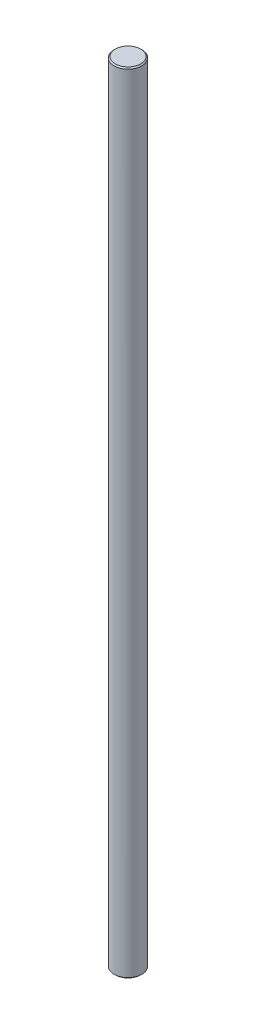
ISO-10303-21;
HEADER;
FILE_DESCRIPTION(('STEP AP214'),'2;1');
FILE_NAME('part.step','',(''),(''),'','','');
FILE_SCHEMA(('AUTOMOTIVE_DESIGN { 1 0 10303 214 1 1 1 1 }'));
ENDSEC;
DATA;
#1=APPLICATION_CONTEXT('core data for automotive mechanical design processes');
#2=APPLICATION_PROTOCOL_DEFINITION('international standard','automotive_design',2000,#1);
#3=PRODUCT_CONTEXT('',#1,'mechanical');
#4=PRODUCT('Part','Part','',(#3));
#5=PRODUCT_RELATED_PRODUCT_CATEGORY('part','',(#4));
#6=PRODUCT_DEFINITION_FORMATION('','',#4);
#7=PRODUCT_DEFINITION_CONTEXT('part definition',#1,'design');
#8=PRODUCT_DEFINITION('design','',#6,#7);
#9=PRODUCT_DEFINITION_SHAPE('','',#8);
#10=(LENGTH_UNIT() NAMED_UNIT(*) SI_UNIT(.MILLI.,.METRE.));
#11=(NAMED_UNIT(*) PLANE_ANGLE_UNIT() SI_UNIT($,.RADIAN.));
#12=(NAMED_UNIT(*) SI_UNIT($,.STERADIAN.) SOLID_ANGLE_UNIT());
#13=UNCERTAINTY_MEASURE_WITH_UNIT(LENGTH_MEASURE(1.E-05),#10,'distance_accuracy_value','');
#14=(GEOMETRIC_REPRESENTATION_CONTEXT(3) GLOBAL_UNCERTAINTY_ASSIGNED_CONTEXT((#13)) GLOBAL_UNIT_ASSIGNED_CONTEXT((#10,
#11,#12)) REPRESENTATION_CONTEXT('',''));
#15=CARTESIAN_POINT('',(0.,0.,0.));
#16=DIRECTION('',(0.,0.,1.));
#17=DIRECTION('',(1.,0.,0.));
#18=AXIS2_PLACEMENT_3D('',#15,#16,#17);
#19=CARTESIAN_POINT('',(0.,0.,0.));
#20=DIRECTION('',(0.,1.,0.));
#21=DIRECTION('',(0.,0.,1.));
#22=AXIS2_PLACEMENT_3D('',#19,#20,#21);
#23=PLANE('',#22);
#24=CARTESIAN_POINT('',(0.,0.,0.));
#25=DIRECTION('',(0.,1.,0.));
#26=DIRECTION('',(0.,0.,1.));
#27=AXIS2_PLACEMENT_3D('',#24,#25,#26);
#28=CIRCLE('',#27,5.49999999998363);
#29=CARTESIAN_POINT('',(0.,0.,5.49999999998363));
#30=VERTEX_POINT('',#29);
#31=EDGE_CURVE('E18',#30,#30,#28,.T.);
#32=ORIENTED_EDGE('',*,*,#31,.F.);
#33=EDGE_LOOP('',(#32));
#34=FACE_BOUND('',#33,.T.);
#35=ADVANCED_FACE('F15',(#34),#23,.F.);
#36=CARTESIAN_POINT('',(0.,339.,0.));
#37=DIRECTION('',(0.,1.,0.));
#38=DIRECTION('',(0.,0.,1.));
#39=AXIS2_PLACEMENT_3D('',#36,#37,#38);
#40=PLANE('',#39);
#41=CARTESIAN_POINT('',(0.,338.999999999999,0.));
#42=DIRECTION('',(0.,-1.,0.));
#43=DIRECTION('',(0.,0.,-1.));
#44=AXIS2_PLACEMENT_3D('',#41,#42,#43);
#45=CIRCLE('',#44,5.49999999992679);
#46=CARTESIAN_POINT('',(0.,338.999999999999,-5.49999999992679));
#47=VERTEX_POINT('',#46);
#48=EDGE_CURVE('E27',#47,#47,#45,.T.);
#49=ORIENTED_EDGE('',*,*,#48,.F.);
#50=EDGE_LOOP('',(#49));
#51=FACE_BOUND('',#50,.T.);
#52=ADVANCED_FACE('F38',(#51),#40,.T.);
#53=CARTESIAN_POINT('',(0.,0.50000000004502,0.));
#54=DIRECTION('',(0.,1.,0.));
#55=DIRECTION('',(0.,0.,1.));
#56=AXIS2_PLACEMENT_3D('',#53,#54,#55);
#57=CONICAL_SURFACE('',#56,5.99999999997181,0.785398163340605);
#58=CARTESIAN_POINT('',(0.,0.500000000000111,0.));
#59=DIRECTION('',(0.,1.,0.));
#60=DIRECTION('',(0.,0.,1.));
#61=AXIS2_PLACEMENT_3D('',#58,#59,#60);
#62=CIRCLE('',#61,6.);
#63=CARTESIAN_POINT('',(0.,0.500000000000111,6.));
#64=VERTEX_POINT('',#63);
#65=EDGE_CURVE('E22',#64,#64,#62,.T.);
#66=ORIENTED_EDGE('',*,*,#65,.F.);
#67=EDGE_LOOP('',(#66));
#68=FACE_BOUND('',#67,.T.);
#69=ORIENTED_EDGE('',*,*,#31,.T.);
#70=EDGE_LOOP('',(#69));
#71=FACE_BOUND('',#70,.T.);
#72=ADVANCED_FACE('F35',(#68,#71),#57,.T.);
#73=CARTESIAN_POINT('',(0.,338.499999999897,0.));
#74=DIRECTION('',(0.,-1.,0.));
#75=DIRECTION('',(0.,0.,-1.));
#76=AXIS2_PLACEMENT_3D('',#73,#74,#75);
#77=CONICAL_SURFACE('',#76,6.00000000002865,0.785398163397448);
#78=ORIENTED_EDGE('',*,*,#48,.T.);
#79=EDGE_LOOP('',(#78));
#80=FACE_BOUND('',#79,.T.);
#81=CARTESIAN_POINT('',(0.,338.5,0.));
#82=DIRECTION('',(0.,1.,0.));
#83=DIRECTION('',(0.,0.,1.));
#84=AXIS2_PLACEMENT_3D('',#81,#82,#83);
#85=CIRCLE('',#84,6.);
#86=CARTESIAN_POINT('',(0.,338.5,6.));
#87=VERTEX_POINT('',#86);
#88=EDGE_CURVE('E9',#87,#87,#85,.F.);
#89=ORIENTED_EDGE('',*,*,#88,.F.);
#90=EDGE_LOOP('',(#89));
#91=FACE_BOUND('',#90,.T.);
#92=ADVANCED_FACE('F46',(#80,#91),#77,.T.);
#93=CARTESIAN_POINT('',(0.,339.,0.));
#94=DIRECTION('',(0.,1.,0.));
#95=DIRECTION('',(0.,0.,1.));
#96=AXIS2_PLACEMENT_3D('',#93,#94,#95);
#97=CYLINDRICAL_SURFACE('',#96,6.);
#98=ORIENTED_EDGE('',*,*,#65,.T.);
#99=EDGE_LOOP('',(#98));
#100=FACE_BOUND('',#99,.T.);
#101=ORIENTED_EDGE('',*,*,#88,.T.);
#102=EDGE_LOOP('',(#101));
#103=FACE_BOUND('',#102,.T.);
#104=ADVANCED_FACE('F44',(#100,#103),#97,.T.);
#105=CLOSED_SHELL('',(#35,#52,#72,#92,#104));
#106=MANIFOLD_SOLID_BREP('B1',#105);
#107=ADVANCED_BREP_SHAPE_REPRESENTATION('',(#18,#106),#14);
#108=SHAPE_DEFINITION_REPRESENTATION(#9,#107);
ENDSEC;
END-ISO-10303-21;
